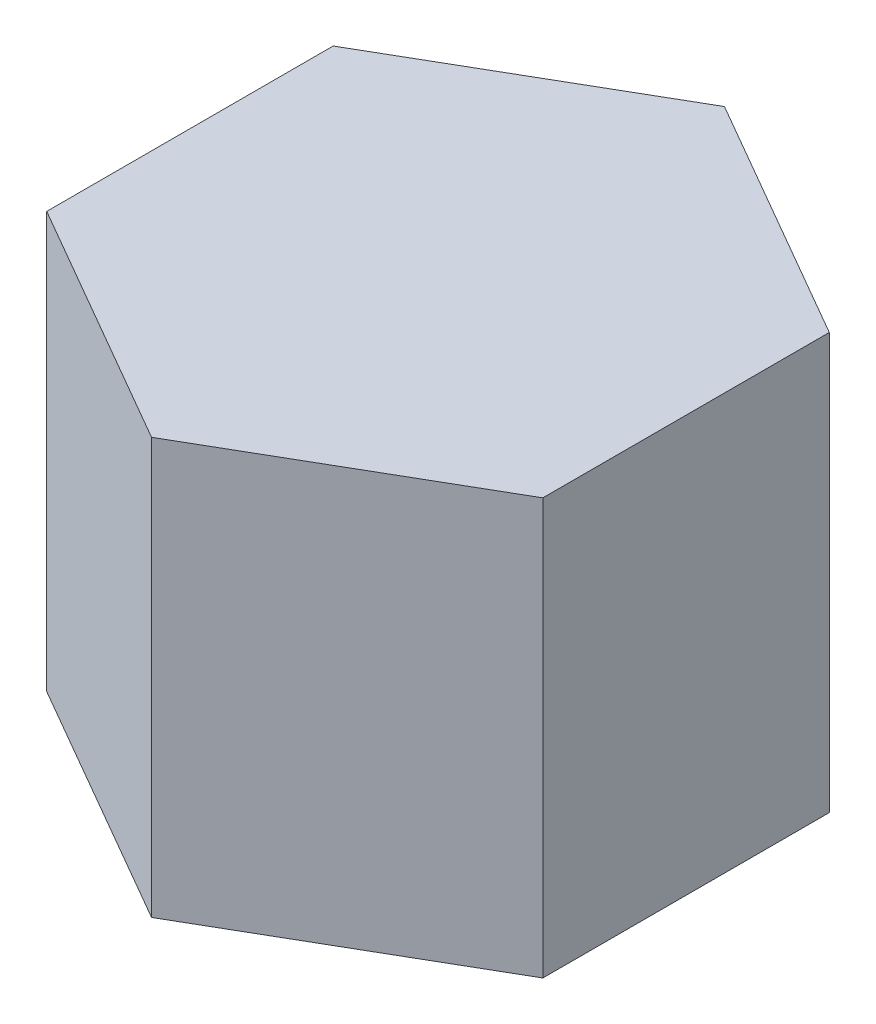
ISO-10303-21;
HEADER;
FILE_DESCRIPTION(('STEP AP214'),'2;1');
FILE_NAME('part.step','',(''),(''),'','','');
FILE_SCHEMA(('AUTOMOTIVE_DESIGN { 1 0 10303 214 1 1 1 1 }'));
ENDSEC;
DATA;
#1=APPLICATION_CONTEXT('core data for automotive mechanical design processes');
#2=APPLICATION_PROTOCOL_DEFINITION('international standard','automotive_design',2000,#1);
#3=PRODUCT_CONTEXT('',#1,'mechanical');
#4=PRODUCT('Part','Part','',(#3));
#5=PRODUCT_RELATED_PRODUCT_CATEGORY('part','',(#4));
#6=PRODUCT_DEFINITION_FORMATION('','',#4);
#7=PRODUCT_DEFINITION_CONTEXT('part definition',#1,'design');
#8=PRODUCT_DEFINITION('design','',#6,#7);
#9=PRODUCT_DEFINITION_SHAPE('','',#8);
#10=(LENGTH_UNIT() NAMED_UNIT(*) SI_UNIT(.MILLI.,.METRE.));
#11=(NAMED_UNIT(*) PLANE_ANGLE_UNIT() SI_UNIT($,.RADIAN.));
#12=(NAMED_UNIT(*) SI_UNIT($,.STERADIAN.) SOLID_ANGLE_UNIT());
#13=UNCERTAINTY_MEASURE_WITH_UNIT(LENGTH_MEASURE(1.E-05),#10,'distance_accuracy_value','');
#14=(GEOMETRIC_REPRESENTATION_CONTEXT(3) GLOBAL_UNCERTAINTY_ASSIGNED_CONTEXT((#13)) GLOBAL_UNIT_ASSIGNED_CONTEXT((#10,
#11,#12)) REPRESENTATION_CONTEXT('',''));
#15=CARTESIAN_POINT('',(0.,0.,0.));
#16=DIRECTION('',(0.,0.,1.));
#17=DIRECTION('',(1.,0.,0.));
#18=AXIS2_PLACEMENT_3D('',#15,#16,#17);
#19=CARTESIAN_POINT('',(210.642660308706,-148.537700895744,293.239022028063));
#20=DIRECTION('',(-0.499999999999909,0.,-0.866025403784491));
#21=DIRECTION('',(-0.866025403784491,0.,0.499999999999909));
#22=AXIS2_PLACEMENT_3D('',#19,#20,#21);
#23=PLANE('',#22);
#24=CARTESIAN_POINT('',(210.339551417382,-149.045793579175,293.414022028063));
#25=DIRECTION('',(0.866025403784491,0.,-0.499999999999909));
#26=VECTOR('',#25,1.);
#27=LINE('',#24,#26);
#28=CARTESIAN_POINT('',(210.339551417382,-149.045793579175,293.414022028063));
#29=VERTEX_POINT('',#28);
#30=CARTESIAN_POINT('',(210.642660308706,-149.045793579175,293.239022028063));
#31=VERTEX_POINT('',#30);
#32=EDGE_CURVE('E170',#29,#31,#27,.T.);
#33=ORIENTED_EDGE('',*,*,#32,.T.);
#34=CARTESIAN_POINT('',(210.642660308706,-148.537700895744,293.239022028063));
#35=DIRECTION('',(0.,-1.,0.));
#36=VECTOR('',#35,1.);
#37=LINE('',#34,#36);
#38=CARTESIAN_POINT('',(210.642660308706,-148.537700895744,293.239022028063));
#39=VERTEX_POINT('',#38);
#40=EDGE_CURVE('E35',#39,#31,#37,.T.);
#41=ORIENTED_EDGE('',*,*,#40,.F.);
#42=CARTESIAN_POINT('',(210.339551417382,-148.537700895744,293.414022028063));
#43=DIRECTION('',(0.866025403784491,0.,-0.499999999999909));
#44=VECTOR('',#43,1.);
#45=LINE('',#42,#44);
#46=CARTESIAN_POINT('',(210.339551417382,-148.537700895744,293.414022028063));
#47=VERTEX_POINT('',#46);
#48=EDGE_CURVE('E159',#47,#39,#45,.T.);
#49=ORIENTED_EDGE('',*,*,#48,.F.);
#50=CARTESIAN_POINT('',(210.339551417382,-148.537700895744,293.414022028063));
#51=DIRECTION('',(0.,-1.,0.));
#52=VECTOR('',#51,1.);
#53=LINE('',#50,#52);
#54=EDGE_CURVE('E10',#47,#29,#53,.T.);
#55=ORIENTED_EDGE('',*,*,#54,.T.);
#56=EDGE_LOOP('',(#33,#41,#49,#55));
#57=FACE_BOUND('',#56,.T.);
#58=ADVANCED_FACE('F16',(#57),#23,.F.);
#59=CARTESIAN_POINT('',(210.339551417382,-148.537700895744,293.414022028063));
#60=DIRECTION('',(0.500000000000096,0.,-0.866025403784383));
#61=DIRECTION('',(-0.866025403784383,0.,-0.500000000000096));
#62=AXIS2_PLACEMENT_3D('',#59,#60,#61);
#63=PLANE('',#62);
#64=CARTESIAN_POINT('',(210.036442526057,-149.045793579175,293.239022028063));
#65=DIRECTION('',(0.866025403784383,0.,0.500000000000096));
#66=VECTOR('',#65,1.);
#67=LINE('',#64,#66);
#68=CARTESIAN_POINT('',(210.036442526057,-149.045793579175,293.239022028063));
#69=VERTEX_POINT('',#68);
#70=EDGE_CURVE('E167',#69,#29,#67,.T.);
#71=ORIENTED_EDGE('',*,*,#70,.T.);
#72=ORIENTED_EDGE('',*,*,#54,.F.);
#73=CARTESIAN_POINT('',(210.036442526057,-148.537700895744,293.239022028063));
#74=DIRECTION('',(0.866025403784383,0.,0.500000000000096));
#75=VECTOR('',#74,1.);
#76=LINE('',#73,#75);
#77=CARTESIAN_POINT('',(210.036442526057,-148.537700895744,293.239022028063));
#78=VERTEX_POINT('',#77);
#79=EDGE_CURVE('E156',#78,#47,#76,.T.);
#80=ORIENTED_EDGE('',*,*,#79,.F.);
#81=CARTESIAN_POINT('',(210.036442526057,-148.537700895744,293.239022028063));
#82=DIRECTION('',(0.,-1.,0.));
#83=VECTOR('',#82,1.);
#84=LINE('',#81,#83);
#85=EDGE_CURVE('E27',#78,#69,#84,.T.);
#86=ORIENTED_EDGE('',*,*,#85,.T.);
#87=EDGE_LOOP('',(#71,#72,#80,#86));
#88=FACE_BOUND('',#87,.T.);
#89=ADVANCED_FACE('F189',(#88),#63,.F.);
#90=CARTESIAN_POINT('',(210.036442526057,-148.537700895744,290.831971220494));
#91=DIRECTION('',(1.,0.,0.));
#92=DIRECTION('',(0.,1.,0.));
#93=AXIS2_PLACEMENT_3D('',#90,#91,#92);
#94=PLANE('',#93);
#95=CARTESIAN_POINT('',(210.036442526057,-149.045793579175,292.889022028063));
#96=DIRECTION('',(0.,0.,1.));
#97=VECTOR('',#96,1.);
#98=LINE('',#95,#97);
#99=CARTESIAN_POINT('',(210.036442526057,-149.045793579175,292.889022028063));
#100=VERTEX_POINT('',#99);
#101=EDGE_CURVE('E163',#100,#69,#98,.T.);
#102=ORIENTED_EDGE('',*,*,#101,.T.);
#103=ORIENTED_EDGE('',*,*,#85,.F.);
#104=CARTESIAN_POINT('',(210.036442526057,-148.537700895744,292.889022028063));
#105=DIRECTION('',(0.,0.,1.));
#106=VECTOR('',#105,1.);
#107=LINE('',#104,#106);
#108=CARTESIAN_POINT('',(210.036442526057,-148.537700895744,292.889022028063));
#109=VERTEX_POINT('',#108);
#110=EDGE_CURVE('E106',#109,#78,#107,.T.);
#111=ORIENTED_EDGE('',*,*,#110,.F.);
#112=CARTESIAN_POINT('',(210.036442526057,-148.537700895744,292.889022028063));
#113=DIRECTION('',(0.,-1.,0.));
#114=VECTOR('',#113,1.);
#115=LINE('',#112,#114);
#116=EDGE_CURVE('E94',#109,#100,#115,.T.);
#117=ORIENTED_EDGE('',*,*,#116,.T.);
#118=EDGE_LOOP('',(#102,#103,#111,#117));
#119=FACE_BOUND('',#118,.T.);
#120=ADVANCED_FACE('F198',(#119),#94,.F.);
#121=CARTESIAN_POINT('',(210.036442526057,-148.537700895744,292.889022028063));
#122=DIRECTION('',(0.499999999999943,0.,0.866025403784472));
#123=DIRECTION('',(0.866025403784472,0.,-0.499999999999943));
#124=AXIS2_PLACEMENT_3D('',#121,#122,#123);
#125=PLANE('',#124);
#126=CARTESIAN_POINT('',(210.339551417382,-149.045793579175,292.714022028063));
#127=DIRECTION('',(-0.866025403784471,0.,0.499999999999943));
#128=VECTOR('',#127,1.);
#129=LINE('',#126,#128);
#130=CARTESIAN_POINT('',(210.339551417382,-149.045793579175,292.714022028063));
#131=VERTEX_POINT('',#130);
#132=EDGE_CURVE('E162',#131,#100,#129,.T.);
#133=ORIENTED_EDGE('',*,*,#132,.T.);
#134=ORIENTED_EDGE('',*,*,#116,.F.);
#135=CARTESIAN_POINT('',(210.339551417382,-148.537700895744,292.714022028063));
#136=DIRECTION('',(-0.866025403784471,0.,0.499999999999943));
#137=VECTOR('',#136,1.);
#138=LINE('',#135,#137);
#139=CARTESIAN_POINT('',(210.339551417382,-148.537700895744,292.714022028063));
#140=VERTEX_POINT('',#139);
#141=EDGE_CURVE('E98',#140,#109,#138,.T.);
#142=ORIENTED_EDGE('',*,*,#141,.F.);
#143=CARTESIAN_POINT('',(210.339551417382,-148.537700895744,292.714022028063));
#144=DIRECTION('',(0.,-1.,0.));
#145=VECTOR('',#144,1.);
#146=LINE('',#143,#145);
#147=EDGE_CURVE('E79',#140,#131,#146,.T.);
#148=ORIENTED_EDGE('',*,*,#147,.T.);
#149=EDGE_LOOP('',(#133,#134,#142,#148));
#150=FACE_BOUND('',#149,.T.);
#151=ADVANCED_FACE('F100',(#150),#125,.F.);
#152=CARTESIAN_POINT('',(210.339551417382,-148.537700895744,292.714022028063));
#153=DIRECTION('',(-0.500000000000062,0.,0.866025403784403));
#154=DIRECTION('',(0.866025403784403,0.,0.500000000000062));
#155=AXIS2_PLACEMENT_3D('',#152,#153,#154);
#156=PLANE('',#155);
#157=CARTESIAN_POINT('',(210.642660308706,-149.045793579175,292.889022028063));
#158=DIRECTION('',(-0.866025403784403,0.,-0.500000000000062));
#159=VECTOR('',#158,1.);
#160=LINE('',#157,#159);
#161=CARTESIAN_POINT('',(210.642660308706,-149.045793579175,292.889022028063));
#162=VERTEX_POINT('',#161);
#163=EDGE_CURVE('E88',#162,#131,#160,.T.);
#164=ORIENTED_EDGE('',*,*,#163,.T.);
#165=ORIENTED_EDGE('',*,*,#147,.F.);
#166=CARTESIAN_POINT('',(210.642660308706,-148.537700895744,292.889022028063));
#167=DIRECTION('',(-0.866025403784403,0.,-0.500000000000062));
#168=VECTOR('',#167,1.);
#169=LINE('',#166,#168);
#170=CARTESIAN_POINT('',(210.642660308706,-148.537700895744,292.889022028063));
#171=VERTEX_POINT('',#170);
#172=EDGE_CURVE('E84',#171,#140,#169,.T.);
#173=ORIENTED_EDGE('',*,*,#172,.F.);
#174=CARTESIAN_POINT('',(210.642660308706,-148.537700895744,292.889022028063));
#175=DIRECTION('',(0.,-1.,0.));
#176=VECTOR('',#175,1.);
#177=LINE('',#174,#176);
#178=EDGE_CURVE('E58',#171,#162,#177,.T.);
#179=ORIENTED_EDGE('',*,*,#178,.T.);
#180=EDGE_LOOP('',(#164,#165,#173,#179));
#181=FACE_BOUND('',#180,.T.);
#182=ADVANCED_FACE('F82',(#181),#156,.F.);
#183=CARTESIAN_POINT('',(210.642660308706,-148.537700895744,290.831971220494));
#184=DIRECTION('',(-1.,0.,0.));
#185=DIRECTION('',(0.,-1.,0.));
#186=AXIS2_PLACEMENT_3D('',#183,#184,#185);
#187=PLANE('',#186);
#188=CARTESIAN_POINT('',(210.642660308706,-149.045793579175,293.239022028063));
#189=DIRECTION('',(0.,0.,-1.));
#190=VECTOR('',#189,1.);
#191=LINE('',#188,#190);
#192=EDGE_CURVE('E160',#31,#162,#191,.T.);
#193=ORIENTED_EDGE('',*,*,#192,.T.);
#194=ORIENTED_EDGE('',*,*,#178,.F.);
#195=CARTESIAN_POINT('',(210.642660308706,-148.537700895744,293.239022028063));
#196=DIRECTION('',(0.,0.,-1.));
#197=VECTOR('',#196,1.);
#198=LINE('',#195,#197);
#199=EDGE_CURVE('E112',#39,#171,#198,.T.);
#200=ORIENTED_EDGE('',*,*,#199,.F.);
#201=ORIENTED_EDGE('',*,*,#40,.T.);
#202=EDGE_LOOP('',(#193,#194,#200,#201));
#203=FACE_BOUND('',#202,.T.);
#204=ADVANCED_FACE('F131',(#203),#187,.F.);
#205=CARTESIAN_POINT('',(206.339551417382,-148.537700895744,290.831971220494));
#206=DIRECTION('',(0.,-1.,0.));
#207=DIRECTION('',(1.,0.,0.));
#208=AXIS2_PLACEMENT_3D('',#205,#206,#207);
#209=PLANE('',#208);
#210=ORIENTED_EDGE('',*,*,#48,.T.);
#211=ORIENTED_EDGE('',*,*,#199,.T.);
#212=ORIENTED_EDGE('',*,*,#172,.T.);
#213=ORIENTED_EDGE('',*,*,#141,.T.);
#214=ORIENTED_EDGE('',*,*,#110,.T.);
#215=ORIENTED_EDGE('',*,*,#79,.T.);
#216=EDGE_LOOP('',(#210,#211,#212,#213,#214,#215));
#217=FACE_BOUND('',#216,.T.);
#218=ADVANCED_FACE('F111',(#217),#209,.F.);
#219=CARTESIAN_POINT('',(206.339551417382,-149.045793579175,290.831971220494));
#220=DIRECTION('',(0.,-1.,0.));
#221=DIRECTION('',(1.,0.,0.));
#222=AXIS2_PLACEMENT_3D('',#219,#220,#221);
#223=PLANE('',#222);
#224=ORIENTED_EDGE('',*,*,#32,.F.);
#225=ORIENTED_EDGE('',*,*,#70,.F.);
#226=ORIENTED_EDGE('',*,*,#101,.F.);
#227=ORIENTED_EDGE('',*,*,#132,.F.);
#228=ORIENTED_EDGE('',*,*,#163,.F.);
#229=ORIENTED_EDGE('',*,*,#192,.F.);
#230=EDGE_LOOP('',(#224,#225,#226,#227,#228,#229));
#231=FACE_BOUND('',#230,.T.);
#232=ADVANCED_FACE('F130',(#231),#223,.T.);
#233=CLOSED_SHELL('',(#58,#89,#120,#151,#182,#204,#218,#232));
#234=MANIFOLD_SOLID_BREP('B1',#233);
#235=ADVANCED_BREP_SHAPE_REPRESENTATION('',(#18,#234),#14);
#236=SHAPE_DEFINITION_REPRESENTATION(#9,#235);
ENDSEC;
END-ISO-10303-21;
